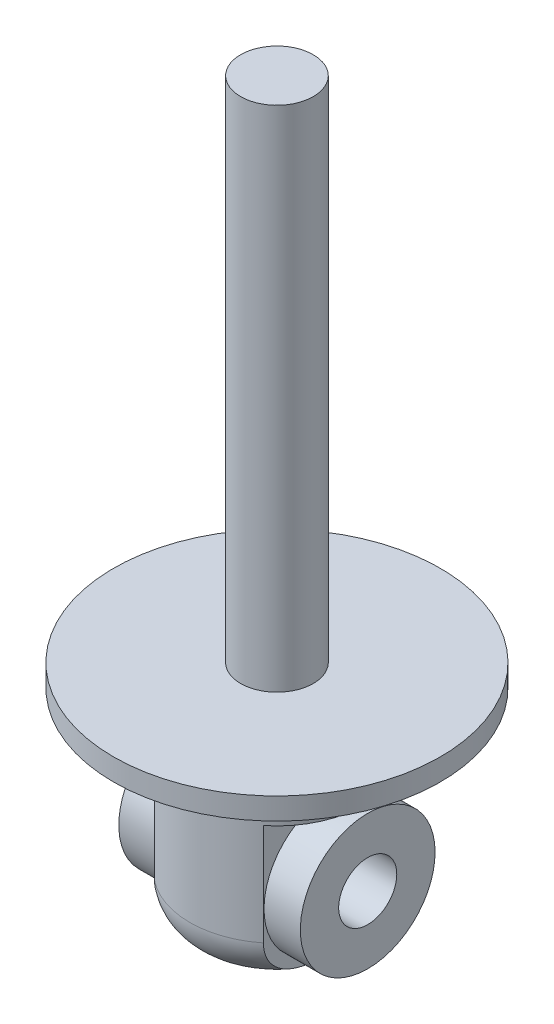
ISO-10303-21;
HEADER;
FILE_DESCRIPTION(('STEP AP214'),'2;1');
FILE_NAME('part.step','',(''),(''),'','','');
FILE_SCHEMA(('AUTOMOTIVE_DESIGN { 1 0 10303 214 1 1 1 1 }'));
ENDSEC;
DATA;
#1=APPLICATION_CONTEXT('core data for automotive mechanical design processes');
#2=APPLICATION_PROTOCOL_DEFINITION('international standard','automotive_design',2000,#1);
#3=PRODUCT_CONTEXT('',#1,'mechanical');
#4=PRODUCT('Part','Part','',(#3));
#5=PRODUCT_RELATED_PRODUCT_CATEGORY('part','',(#4));
#6=PRODUCT_DEFINITION_FORMATION('','',#4);
#7=PRODUCT_DEFINITION_CONTEXT('part definition',#1,'design');
#8=PRODUCT_DEFINITION('design','',#6,#7);
#9=PRODUCT_DEFINITION_SHAPE('','',#8);
#10=(LENGTH_UNIT() NAMED_UNIT(*) SI_UNIT(.MILLI.,.METRE.));
#11=(NAMED_UNIT(*) PLANE_ANGLE_UNIT() SI_UNIT($,.RADIAN.));
#12=(NAMED_UNIT(*) SI_UNIT($,.STERADIAN.) SOLID_ANGLE_UNIT());
#13=UNCERTAINTY_MEASURE_WITH_UNIT(LENGTH_MEASURE(1.E-05),#10,'distance_accuracy_value','');
#14=(GEOMETRIC_REPRESENTATION_CONTEXT(3) GLOBAL_UNCERTAINTY_ASSIGNED_CONTEXT((#13)) GLOBAL_UNIT_ASSIGNED_CONTEXT((#10,
#11,#12)) REPRESENTATION_CONTEXT('',''));
#15=CARTESIAN_POINT('',(0.,0.,0.));
#16=DIRECTION('',(0.,0.,1.));
#17=DIRECTION('',(1.,0.,0.));
#18=AXIS2_PLACEMENT_3D('',#15,#16,#17);
#19=CARTESIAN_POINT('',(7.5,-8.,-22.5));
#20=DIRECTION('',(-1.,0.,0.));
#21=DIRECTION('',(0.,-1.,0.));
#22=AXIS2_PLACEMENT_3D('',#19,#20,#21);
#23=PLANE('',#22);
#24=CARTESIAN_POINT('',(7.5,-27.8094750193111,0.));
#25=CARTESIAN_POINT('',(7.5,-27.8094752958151,-0.18452162824242));
#26=CARTESIAN_POINT('',(7.5,-27.8077270322999,-0.369043480287192));
#27=CARTESIAN_POINT('',(7.5,-27.8006130628877,-0.737999394292285));
#28=CARTESIAN_POINT('',(7.5,-27.7952477367066,-0.922433463434386));
#29=CARTESIAN_POINT('',(7.5,-27.780538513706,-1.29122559425462));
#30=CARTESIAN_POINT('',(7.5,-27.7711929215574,-1.47558358999919));
#31=CARTESIAN_POINT('',(7.5,-27.7479507640883,-1.84401846668315));
#32=CARTESIAN_POINT('',(7.5,-27.734054140347,-2.0280953439834));
#33=CARTESIAN_POINT('',(7.5,-27.701027325669,-2.39498843631837));
#34=CARTESIAN_POINT('',(7.5,-27.6819201299087,-2.57780665418327));
#35=CARTESIAN_POINT('',(7.5,-27.6375682217561,-2.94269408038084));
#36=CARTESIAN_POINT('',(7.5,-27.6123230495969,-3.12476323156505));
#37=CARTESIAN_POINT('',(7.5,-27.5259360262262,-3.6691632505479));
#38=CARTESIAN_POINT('',(7.5,-27.4541196223952,-4.02997739530099));
#39=CARTESIAN_POINT('',(7.5,-27.315114172541,-4.57935988961709));
#40=CARTESIAN_POINT('',(7.5,-27.2608348848703,-4.7712225645297));
#41=CARTESIAN_POINT('',(7.5,-27.1402411036094,-5.15109529504943));
#42=CARTESIAN_POINT('',(7.5,-27.0739312594077,-5.3391068078654));
#43=CARTESIAN_POINT('',(7.5,-26.9281486989919,-5.70992505463463));
#44=CARTESIAN_POINT('',(7.5,-26.8486797977089,-5.8927332791208));
#45=CARTESIAN_POINT('',(7.5,-26.6756224712841,-6.25155879665883));
#46=CARTESIAN_POINT('',(7.5,-26.5820364486501,-6.42757723883459));
#47=CARTESIAN_POINT('',(7.5,-26.3958384208508,-6.74413785402998));
#48=CARTESIAN_POINT('',(7.5,-26.3053527427416,-6.8859302136676));
#49=CARTESIAN_POINT('',(7.5,-26.1136422044668,-7.16205254122039));
#50=CARTESIAN_POINT('',(7.5,-26.0124194056704,-7.29638393401336));
#51=CARTESIAN_POINT('',(7.5,-25.7991822855038,-7.55627452274061));
#52=CARTESIAN_POINT('',(7.5,-25.6871652583255,-7.6818315054992));
#53=CARTESIAN_POINT('',(7.5,-25.4525813942248,-7.92270374400352));
#54=CARTESIAN_POINT('',(7.5,-25.3300144777409,-8.03801892249803));
#55=CARTESIAN_POINT('',(7.5,-25.0736714823962,-8.25792234562975));
#56=CARTESIAN_POINT('',(7.5,-24.9398051473305,-8.36240569865935));
#57=CARTESIAN_POINT('',(7.5,-24.662616920615,-8.55796576900282));
#58=CARTESIAN_POINT('',(7.5,-24.5192963548439,-8.64904436046083));
#59=CARTESIAN_POINT('',(7.5,-24.2243409104845,-8.81636481076627));
#60=CARTESIAN_POINT('',(7.5,-24.0727112205184,-8.89261579636783));
#61=CARTESIAN_POINT('',(7.5,-23.7624095052739,-9.02909243430965));
#62=CARTESIAN_POINT('',(7.5,-23.6037388369551,-9.08932115899453));
#63=CARTESIAN_POINT('',(7.5,-23.3052245459151,-9.1849514334904));
#64=CARTESIAN_POINT('',(7.5,-23.166136129491,-9.22272405795733));
#65=CARTESIAN_POINT('',(7.5,-22.8851087613884,-9.28547940350163));
#66=CARTESIAN_POINT('',(7.5,-22.7431701638949,-9.31046370365637));
#67=CARTESIAN_POINT('',(7.5,-22.4576599589478,-9.34730641699015));
#68=CARTESIAN_POINT('',(7.5,-22.3140890586128,-9.35917031033292));
#69=CARTESIAN_POINT('',(7.5,-22.0264648581988,-9.36963164548865));
#70=CARTESIAN_POINT('',(7.5,-21.8824115750842,-9.36822954903947));
#71=CARTESIAN_POINT('',(7.5,-21.6061914815275,-9.35280339576898));
#72=CARTESIAN_POINT('',(7.5,-21.4739684759153,-9.33976569953801));
#73=CARTESIAN_POINT('',(7.5,-21.2110534946456,-9.3025636387872));
#74=CARTESIAN_POINT('',(7.5,-21.0803620180608,-9.27839574533065));
#75=CARTESIAN_POINT('',(7.5,-20.8215410609612,-9.21922065645586));
#76=CARTESIAN_POINT('',(7.5,-20.6934101253726,-9.1842198149556));
#77=CARTESIAN_POINT('',(7.5,-20.4404340442512,-9.1037455253616));
#78=CARTESIAN_POINT('',(7.5,-20.3155901493276,-9.05826815366643));
#79=CARTESIAN_POINT('',(7.5,-20.0692031015505,-8.95699564520569));
#80=CARTESIAN_POINT('',(7.5,-19.9476868658852,-8.90113499399755));
#81=CARTESIAN_POINT('',(7.5,-19.7094920695403,-8.77987692751896));
#82=CARTESIAN_POINT('',(7.5,-19.5928152563103,-8.71447610526942));
#83=CARTESIAN_POINT('',(7.5,-19.2509911073174,-8.50489875856371));
#84=CARTESIAN_POINT('',(7.5,-19.0339195251877,-8.34729299116933));
#85=CARTESIAN_POINT('',(7.5,-18.609337427954,-7.98870608163152));
#86=CARTESIAN_POINT('',(7.5,-18.4039002281567,-7.78529755950601));
#87=CARTESIAN_POINT('',(7.5,-18.0246758733926,-7.35109040646742));
#88=CARTESIAN_POINT('',(7.5,-17.8508837047537,-7.12029612399674));
#89=CARTESIAN_POINT('',(7.5,-17.5744409595824,-6.69864287979114));
#90=CARTESIAN_POINT('',(7.5,-17.4648689537028,-6.51223410047272));
#91=CARTESIAN_POINT('',(7.5,-17.2626904112622,-6.13034538679085));
#92=CARTESIAN_POINT('',(7.5,-17.1700919878543,-5.93486117014358));
#93=CARTESIAN_POINT('',(7.5,-17.0006313082269,-5.53658641063457));
#94=CARTESIAN_POINT('',(7.5,-16.9238147555949,-5.33377659321379));
#95=CARTESIAN_POINT('',(7.5,-16.784875362625,-4.92331428460809));
#96=CARTESIAN_POINT('',(7.5,-16.7227484430634,-4.71566315546473));
#97=CARTESIAN_POINT('',(7.5,-16.5386673542946,-4.02250667384634));
#98=CARTESIAN_POINT('',(7.5,-16.4449803111871,-3.5294265636988));
#99=CARTESIAN_POINT('',(7.5,-16.3412352530644,-2.78498720051465));
#100=CARTESIAN_POINT('',(7.5,-16.3127705467372,-2.53568557770048));
#101=CARTESIAN_POINT('',(7.5,-16.2658269581612,-2.03612434937437));
#102=CARTESIAN_POINT('',(7.5,-16.2473468655649,-1.7858648636814));
#103=CARTESIAN_POINT('',(7.5,-16.2184283009414,-1.28363112408651));
#104=CARTESIAN_POINT('',(7.5,-16.208031590786,-1.0316546617609));
#105=CARTESIAN_POINT('',(7.5,-16.1941849220444,-0.527501194688666));
#106=CARTESIAN_POINT('',(7.5,-16.1907352988047,-0.275324180848896));
#107=CARTESIAN_POINT('',(7.5,-16.1903333462322,0.228731345602991));
#108=CARTESIAN_POINT('',(7.5,-16.193373232494,0.480609853630189));
#109=CARTESIAN_POINT('',(7.5,-16.2063332691715,0.984173581494281));
#110=CARTESIAN_POINT('',(7.5,-16.2162528039696,1.23585881660875));
#111=CARTESIAN_POINT('',(7.5,-16.2454935008677,1.76278825668935));
#112=CARTESIAN_POINT('',(7.5,-16.2656211327378,2.03798990109173));
#113=CARTESIAN_POINT('',(7.5,-16.3180418431018,2.5873134597684));
#114=CARTESIAN_POINT('',(7.5,-16.3503365349836,2.86143522597445));
#115=CARTESIAN_POINT('',(7.5,-16.4300545548583,3.40623279358438));
#116=CARTESIAN_POINT('',(7.5,-16.4774071358833,3.67691867401874));
#117=CARTESIAN_POINT('',(7.5,-16.5907053400646,4.21439476079952));
#118=CARTESIAN_POINT('',(7.5,-16.6566449229111,4.48118620316471));
#119=CARTESIAN_POINT('',(7.5,-16.7911834026755,4.94217748017443));
#120=CARTESIAN_POINT('',(7.5,-16.8549558474619,5.13778160857808));
#121=CARTESIAN_POINT('',(7.5,-16.9961265709521,5.5239942274174));
#122=CARTESIAN_POINT('',(7.5,-17.073520789267,5.71460418712137));
#123=CARTESIAN_POINT('',(7.5,-17.2430793617625,6.0892198722189));
#124=CARTESIAN_POINT('',(7.5,-17.3352463319138,6.27322442084439));
#125=CARTESIAN_POINT('',(7.5,-17.5351759469553,6.63256976145458));
#126=CARTESIAN_POINT('',(7.5,-17.6429345063483,6.80791280693598));
#127=CARTESIAN_POINT('',(7.5,-17.8487615005737,7.10989658300674));
#128=CARTESIAN_POINT('',(7.5,-17.9436617626469,7.2387010399764));
#129=CARTESIAN_POINT('',(7.5,-18.143229826346,7.4885662206622));
#130=CARTESIAN_POINT('',(7.5,-18.2478987883735,7.60962602152205));
#131=CARTESIAN_POINT('',(7.5,-18.4668045949393,7.84271387792474));
#132=CARTESIAN_POINT('',(7.5,-18.5810384459287,7.95474473789612));
#133=CARTESIAN_POINT('',(7.5,-18.8187268203134,8.16854933672494));
#134=CARTESIAN_POINT('',(7.5,-18.9421800591116,8.27032449994957));
#135=CARTESIAN_POINT('',(7.5,-19.1987356397018,8.46313596223061));
#136=CARTESIAN_POINT('',(7.5,-19.3319055781875,8.55408255407203));
#137=CARTESIAN_POINT('',(7.5,-19.6061418402457,8.72304401015934));
#138=CARTESIAN_POINT('',(7.5,-19.747204378254,8.80106500403696));
#139=CARTESIAN_POINT('',(7.5,-20.0362068877473,8.94309470867639));
#140=CARTESIAN_POINT('',(7.5,-20.1841460034049,9.00710515749598));
#141=CARTESIAN_POINT('',(7.5,-20.4856380297523,9.12014361193692));
#142=CARTESIAN_POINT('',(7.5,-20.6391901444676,9.16917373274798));
#143=CARTESIAN_POINT('',(7.5,-20.9313639562727,9.24643392787081));
#144=CARTESIAN_POINT('',(7.5,-21.0695088202567,9.27647685632879));
#145=CARTESIAN_POINT('',(7.5,-21.3479315795213,9.32406143536891));
#146=CARTESIAN_POINT('',(7.5,-21.4882092809527,9.34160421520928));
#147=CARTESIAN_POINT('',(7.5,-21.769719609589,9.36396002322678));
#148=CARTESIAN_POINT('',(7.5,-21.9109518422674,9.3687780225304));
#149=CARTESIAN_POINT('',(7.5,-22.1932734390957,9.3656361390626));
#150=CARTESIAN_POINT('',(7.5,-22.3343628067459,9.35767657732181));
#151=CARTESIAN_POINT('',(7.5,-22.6064011749062,9.32998563551062));
#152=CARTESIAN_POINT('',(7.5,-22.7374295539783,9.31102660205278));
#153=CARTESIAN_POINT('',(7.5,-22.9974780227225,9.26218788836621));
#154=CARTESIAN_POINT('',(7.5,-23.1264974548056,9.23230470755187));
#155=CARTESIAN_POINT('',(7.5,-23.3815508516768,9.16196479385525));
#156=CARTESIAN_POINT('',(7.5,-23.5075862018083,9.12151307666088));
#157=CARTESIAN_POINT('',(7.5,-23.7559772755244,9.03044888037393));
#158=CARTESIAN_POINT('',(7.5,-23.8783315975104,8.97983258590813));
#159=CARTESIAN_POINT('',(7.5,-24.1205569584555,8.86806175742509));
#160=CARTESIAN_POINT('',(7.5,-24.2403549182387,8.8067487702029));
#161=CARTESIAN_POINT('',(7.5,-24.4747211723639,8.67480187441993));
#162=CARTESIAN_POINT('',(7.5,-24.5892875713423,8.60416462323316));
#163=CARTESIAN_POINT('',(7.5,-24.9242270275788,8.37928997825773));
#164=CARTESIAN_POINT('',(7.5,-25.13600210755,8.21201407264851));
#165=CARTESIAN_POINT('',(7.5,-25.5504485361803,7.832942739178));
#166=CARTESIAN_POINT('',(7.5,-25.7507010772538,7.61853228584699));
#167=CARTESIAN_POINT('',(7.5,-26.1185076671662,7.16337882817298));
#168=CARTESIAN_POINT('',(7.5,-26.2860513710234,6.92262753032979));
#169=CARTESIAN_POINT('',(7.5,-26.5545024709803,6.4788664395953));
#170=CARTESIAN_POINT('',(7.5,-26.6619013252763,6.27970729507799));
#171=CARTESIAN_POINT('',(7.5,-26.858559219587,5.87254463104012));
#172=CARTESIAN_POINT('',(7.5,-26.9478095430477,5.664536919364));
#173=CARTESIAN_POINT('',(7.5,-27.1096214973705,5.24180758530232));
#174=CARTESIAN_POINT('',(7.5,-27.1821555960046,5.02707553901331));
#175=CARTESIAN_POINT('',(7.5,-27.3121001369762,4.59305326757355));
#176=CARTESIAN_POINT('',(7.5,-27.3695048137837,4.37376133898656));
#177=CARTESIAN_POINT('',(7.5,-27.4981886749365,3.81417726059936));
#178=CARTESIAN_POINT('',(7.5,-27.5604951716191,3.47183296905169));
#179=CARTESIAN_POINT('',(7.5,-27.6609019684328,2.78359200614869));
#180=CARTESIAN_POINT('',(7.5,-27.6989863972919,2.43769315620305));
#181=CARTESIAN_POINT('',(7.5,-27.7425563308733,1.91723181279187));
#182=CARTESIAN_POINT('',(7.5,-27.7548291128016,1.74318957751326));
#183=CARTESIAN_POINT('',(7.5,-27.7753986995787,1.39487161182967));
#184=CARTESIAN_POINT('',(7.5,-27.7836956019396,1.22059588725638));
#185=CARTESIAN_POINT('',(7.5,-27.796777523185,0.871965392986036));
#186=CARTESIAN_POINT('',(7.5,-27.8015635129394,0.697610658492169));
#187=CARTESIAN_POINT('',(7.5,-27.8079121855994,0.348837350643893));
#188=CARTESIAN_POINT('',(7.5,-27.8094747579462,0.174418775305038));
#189=CARTESIAN_POINT('',(7.5,-27.8094750193111,0.));
#190=B_SPLINE_CURVE_WITH_KNOTS('',3,(#24,#25,#26,#27,#28,#29,#30,#31,#32,#33,#34,#35,#36,#37,
#38,#39,#40,#41,#42,#43,#44,#45,#46,#47,#48,#49,#50,#51,#52,#53,#54,#55,#56,#57,#58,#59,#60,#61,
#62,#63,#64,#65,#66,#67,#68,#69,#70,#71,#72,#73,#74,#75,#76,#77,#78,#79,#80,#81,#82,#83,#84,#85,
#86,#87,#88,#89,#90,#91,#92,#93,#94,#95,#96,#97,#98,#99,#100,#101,#102,#103,#104,#105,#106,#107,
#108,#109,#110,#111,#112,#113,#114,#115,#116,#117,#118,#119,#120,#121,#122,#123,#124,#125,#126,
#127,#128,#129,#130,#131,#132,#133,#134,#135,#136,#137,#138,#139,#140,#141,#142,#143,#144,#145,
#146,#147,#148,#149,#150,#151,#152,#153,#154,#155,#156,#157,#158,#159,#160,#161,#162,#163,#164,
#165,#166,#167,#168,#169,#170,#171,#172,#173,#174,#175,#176,#177,#178,#179,#180,#181,#182,#183,
#184,#185,#186,#187,#188,#189),.UNSPECIFIED.,.T.,.F.,(4,2,2,2,2,2,2,2,2,2,2,2,2,2,2,2,2,2,2,2,2,
2,2,2,2,2,2,2,2,2,2,2,2,2,2,2,2,2,2,2,2,2,2,2,2,2,2,2,2,2,2,2,2,2,2,2,2,2,2,2,2,2,2,2,2,2,2,2,2,
2,2,2,2,2,2,2,2,2,2,2,2,2,4),(0.,0.553556541747909,1.10705498067111,1.66078940935171,
2.21453094651203,2.7658672034967,3.31724477121586,4.41912680182767,5.01698525599298,
5.61461314908643,6.21206808675635,6.80942146164093,7.31357153503217,7.81762499361292,
8.32180513447662,8.82598907791494,9.33467160980089,9.84328295415677,10.3515802378956,
10.8597799828438,11.291588037567,11.7233427606026,12.1549170790764,12.5864763761707,
12.9845986570771,13.3828472534997,13.7808627038906,14.1790274594522,14.579795450788,
14.9807069160888,15.7821103743006,16.6461503316802,17.5100532757815,18.1578732554314,
18.8060020817716,19.4559821948789,20.1057815998326,21.6069748462106,22.3596793389022,
23.1122925673176,23.8687687149109,24.6252813779039,25.3808870860739,26.1364251884592,
26.9640249034878,27.7917343993232,28.6156111127982,29.4392203950451,30.0559954213971,
30.6725869093732,31.2892877047367,31.9058271963482,32.3853559200308,32.8649416785199,
33.3443778968313,33.823747436381,34.3068464150843,34.7897156366603,35.2725249226045,
35.7552660053908,36.1788379642465,36.6023716529342,37.0257398573389,37.4490974249689,
37.8458122806135,38.2426543730445,38.6393084704929,39.0361117351622,39.4393886143667,
39.8428104576491,40.6491243408277,41.5260051520067,42.4031628508039,43.0810551134699,
43.7592721958252,44.4385984678267,45.1181832448308,46.1608437011148,47.2041866484774,
47.7275747628343,48.2509500399341,48.7741805338585,49.2974289735857),.UNSPECIFIED.);
#191=CARTESIAN_POINT('',(7.5,-22.,9.3674969975976));
#192=VERTEX_POINT('',#191);
#193=CARTESIAN_POINT('',(7.5,-21.9999999999999,-9.36749699759765));
#194=VERTEX_POINT('',#193);
#195=EDGE_CURVE('E126',#192,#194,#190,.T.);
#196=ORIENTED_EDGE('',*,*,#195,.T.);
#197=DIRECTION('',(0.,1.,0.));
#198=VECTOR('',#197,1.);
#199=CARTESIAN_POINT('',(7.5,-28.,-9.3674969975976));
#200=LINE('',#199,#198);
#201=CARTESIAN_POINT('',(7.5,-8.,-9.3674969975976));
#202=VERTEX_POINT('',#201);
#203=EDGE_CURVE('E100',#202,#194,#200,.F.);
#204=ORIENTED_EDGE('',*,*,#203,.F.);
#205=DIRECTION('',(0.,0.,1.));
#206=VECTOR('',#205,1.);
#207=CARTESIAN_POINT('',(7.5,-8.,-22.5));
#208=LINE('',#207,#206);
#209=CARTESIAN_POINT('',(7.5,-8.,9.3674969975976));
#210=VERTEX_POINT('',#209);
#211=EDGE_CURVE('E97',#202,#210,#208,.T.);
#212=ORIENTED_EDGE('',*,*,#211,.T.);
#213=DIRECTION('',(0.,1.,0.));
#214=VECTOR('',#213,1.);
#215=CARTESIAN_POINT('',(7.5,-28.,9.3674969975976));
#216=LINE('',#215,#214);
#217=EDGE_CURVE('E105',#192,#210,#216,.T.);
#218=ORIENTED_EDGE('',*,*,#217,.F.);
#219=EDGE_LOOP('',(#196,#204,#212,#218));
#220=FACE_BOUND('',#219,.T.);
#221=CARTESIAN_POINT('',(7.5,-18.,0.));
#222=DIRECTION('',(-1.,0.,0.));
#223=DIRECTION('',(0.,-1.,0.));
#224=AXIS2_PLACEMENT_3D('',#221,#222,#223);
#225=CIRCLE('',#224,9.27822291982509);
#226=CARTESIAN_POINT('',(7.5,-27.2782229198251,0.));
#227=VERTEX_POINT('',#226);
#228=EDGE_CURVE('E11',#227,#227,#225,.F.);
#229=ORIENTED_EDGE('',*,*,#228,.F.);
#230=EDGE_LOOP('',(#229));
#231=FACE_BOUND('',#230,.T.);
#232=ADVANCED_FACE('F36',(#220,#231),#23,.F.);
#233=CARTESIAN_POINT('',(-7.5,-8.,-22.5));
#234=DIRECTION('',(1.,0.,0.));
#235=DIRECTION('',(0.,1.,0.));
#236=AXIS2_PLACEMENT_3D('',#233,#234,#235);
#237=PLANE('',#236);
#238=CARTESIAN_POINT('',(-7.5,-27.8094750193111,0.));
#239=CARTESIAN_POINT('',(-7.5,-27.8094752958151,0.184521628242419));
#240=CARTESIAN_POINT('',(-7.5,-27.8077270322999,0.369043480287191));
#241=CARTESIAN_POINT('',(-7.5,-27.8006130628877,0.737999394292284));
#242=CARTESIAN_POINT('',(-7.5,-27.7952477367066,0.922433463434383));
#243=CARTESIAN_POINT('',(-7.5,-27.780538513706,1.29122559425462));
#244=CARTESIAN_POINT('',(-7.5,-27.7711929215574,1.47558358999919));
#245=CARTESIAN_POINT('',(-7.5,-27.7479507640883,1.84401846668315));
#246=CARTESIAN_POINT('',(-7.5,-27.734054140347,2.02809534398339));
#247=CARTESIAN_POINT('',(-7.5,-27.701027325669,2.39498843631837));
#248=CARTESIAN_POINT('',(-7.5,-27.6819201299087,2.57780665418326));
#249=CARTESIAN_POINT('',(-7.5,-27.6375682217561,2.94269408038083));
#250=CARTESIAN_POINT('',(-7.5,-27.6123230495969,3.12476323156505));
#251=CARTESIAN_POINT('',(-7.5,-27.5259360262262,3.6691632505479));
#252=CARTESIAN_POINT('',(-7.5,-27.4541196223952,4.02997739530099));
#253=CARTESIAN_POINT('',(-7.5,-27.315114172541,4.57935988961709));
#254=CARTESIAN_POINT('',(-7.5,-27.2608348848703,4.77122256452969));
#255=CARTESIAN_POINT('',(-7.5,-27.1402411036094,5.15109529504942));
#256=CARTESIAN_POINT('',(-7.5,-27.0739312594077,5.33910680786539));
#257=CARTESIAN_POINT('',(-7.5,-26.928148698992,5.70992505463463));
#258=CARTESIAN_POINT('',(-7.5,-26.8486797977089,5.8927332791208));
#259=CARTESIAN_POINT('',(-7.5,-26.6756224712841,6.25155879665883));
#260=CARTESIAN_POINT('',(-7.5,-26.5820364486502,6.42757723883459));
#261=CARTESIAN_POINT('',(-7.5,-26.3958384208508,6.74413785402998));
#262=CARTESIAN_POINT('',(-7.5,-26.3053527427416,6.8859302136676));
#263=CARTESIAN_POINT('',(-7.5,-26.1136422044668,7.16205254122039));
#264=CARTESIAN_POINT('',(-7.5,-26.0124194056704,7.29638393401336));
#265=CARTESIAN_POINT('',(-7.5,-25.7991822855038,7.55627452274061));
#266=CARTESIAN_POINT('',(-7.5,-25.6871652583255,7.6818315054992));
#267=CARTESIAN_POINT('',(-7.5,-25.4525813942248,7.92270374400352));
#268=CARTESIAN_POINT('',(-7.5,-25.3300144777409,8.03801892249803));
#269=CARTESIAN_POINT('',(-7.5,-25.0736714823962,8.25792234562975));
#270=CARTESIAN_POINT('',(-7.5,-24.9398051473305,8.36240569865935));
#271=CARTESIAN_POINT('',(-7.5,-24.662616920615,8.55796576900282));
#272=CARTESIAN_POINT('',(-7.5,-24.5192963548439,8.64904436046083));
#273=CARTESIAN_POINT('',(-7.5,-24.2243409104845,8.81636481076627));
#274=CARTESIAN_POINT('',(-7.5,-24.0727112205184,8.89261579636784));
#275=CARTESIAN_POINT('',(-7.5,-23.7624095052739,9.02909243430965));
#276=CARTESIAN_POINT('',(-7.5,-23.6037388369551,9.08932115899453));
#277=CARTESIAN_POINT('',(-7.5,-23.3052245459151,9.1849514334904));
#278=CARTESIAN_POINT('',(-7.5,-23.1661361294911,9.22272405795734));
#279=CARTESIAN_POINT('',(-7.5,-22.8851087613884,9.28547940350164));
#280=CARTESIAN_POINT('',(-7.5,-22.7431701638949,9.31046370365637));
#281=CARTESIAN_POINT('',(-7.5,-22.4576599589478,9.34730641699016));
#282=CARTESIAN_POINT('',(-7.5,-22.3140890586128,9.35917031033292));
#283=CARTESIAN_POINT('',(-7.5,-22.0264648581988,9.36963164548865));
#284=CARTESIAN_POINT('',(-7.5,-21.8824115750842,9.36822954903948));
#285=CARTESIAN_POINT('',(-7.5,-21.6061914815275,9.35280339576898));
#286=CARTESIAN_POINT('',(-7.5,-21.4739684759154,9.33976569953801));
#287=CARTESIAN_POINT('',(-7.5,-21.2110534946456,9.30256363878721));
#288=CARTESIAN_POINT('',(-7.5,-21.0803620180608,9.27839574533066));
#289=CARTESIAN_POINT('',(-7.5,-20.8215410609612,9.21922065645586));
#290=CARTESIAN_POINT('',(-7.5,-20.6934101253726,9.18421981495561));
#291=CARTESIAN_POINT('',(-7.5,-20.4404340442512,9.10374552536161));
#292=CARTESIAN_POINT('',(-7.5,-20.3155901493276,9.05826815366643));
#293=CARTESIAN_POINT('',(-7.5,-20.0692031015505,8.95699564520569));
#294=CARTESIAN_POINT('',(-7.5,-19.9476868658852,8.90113499399756));
#295=CARTESIAN_POINT('',(-7.5,-19.7094920695403,8.77987692751897));
#296=CARTESIAN_POINT('',(-7.5,-19.5928152563103,8.71447610526943));
#297=CARTESIAN_POINT('',(-7.5,-19.2509911073174,8.50489875856372));
#298=CARTESIAN_POINT('',(-7.5,-19.0339195251877,8.34729299116935));
#299=CARTESIAN_POINT('',(-7.5,-18.609337427954,7.98870608163153));
#300=CARTESIAN_POINT('',(-7.5,-18.4039002281567,7.78529755950601));
#301=CARTESIAN_POINT('',(-7.5,-18.0246758733926,7.35109040646743));
#302=CARTESIAN_POINT('',(-7.5,-17.8508837047537,7.12029612399674));
#303=CARTESIAN_POINT('',(-7.5,-17.5744409595824,6.69864287979115));
#304=CARTESIAN_POINT('',(-7.5,-17.4648689537028,6.51223410047273));
#305=CARTESIAN_POINT('',(-7.5,-17.2626904112623,6.13034538679086));
#306=CARTESIAN_POINT('',(-7.5,-17.1700919878543,5.93486117014359));
#307=CARTESIAN_POINT('',(-7.5,-17.0006313082269,5.53658641063458));
#308=CARTESIAN_POINT('',(-7.5,-16.9238147555949,5.33377659321381));
#309=CARTESIAN_POINT('',(-7.5,-16.784875362625,4.92331428460811));
#310=CARTESIAN_POINT('',(-7.5,-16.7227484430634,4.71566315546475));
#311=CARTESIAN_POINT('',(-7.5,-16.5386673542946,4.02250667384636));
#312=CARTESIAN_POINT('',(-7.5,-16.4449803111871,3.52942656369883));
#313=CARTESIAN_POINT('',(-7.5,-16.3412352530644,2.78498720051468));
#314=CARTESIAN_POINT('',(-7.5,-16.3127705467372,2.53568557770051));
#315=CARTESIAN_POINT('',(-7.5,-16.2658269581612,2.0361243493744));
#316=CARTESIAN_POINT('',(-7.5,-16.2473468655649,1.78586486368144));
#317=CARTESIAN_POINT('',(-7.5,-16.2184283009414,1.28363112408655));
#318=CARTESIAN_POINT('',(-7.5,-16.208031590786,1.03165466176094));
#319=CARTESIAN_POINT('',(-7.5,-16.1941849220444,0.527501194688707));
#320=CARTESIAN_POINT('',(-7.5,-16.1907352988047,0.27532418084894));
#321=CARTESIAN_POINT('',(-7.5,-16.1903333462322,-0.228731345602946));
#322=CARTESIAN_POINT('',(-7.5,-16.193373232494,-0.480609853630145));
#323=CARTESIAN_POINT('',(-7.5,-16.2063332691715,-0.984173581494236));
#324=CARTESIAN_POINT('',(-7.5,-16.2162528039696,-1.23585881660871));
#325=CARTESIAN_POINT('',(-7.5,-16.2454935008677,-1.7627882566893));
#326=CARTESIAN_POINT('',(-7.5,-16.2656211327378,-2.03798990109168));
#327=CARTESIAN_POINT('',(-7.5,-16.3180418431017,-2.58731345976836));
#328=CARTESIAN_POINT('',(-7.5,-16.3503365349836,-2.86143522597441));
#329=CARTESIAN_POINT('',(-7.5,-16.4300545548583,-3.40623279358435));
#330=CARTESIAN_POINT('',(-7.5,-16.4774071358833,-3.67691867401872));
#331=CARTESIAN_POINT('',(-7.5,-16.5907053400646,-4.2143947607995));
#332=CARTESIAN_POINT('',(-7.5,-16.6566449229111,-4.48118620316469));
#333=CARTESIAN_POINT('',(-7.5,-16.7911834026755,-4.94217748017442));
#334=CARTESIAN_POINT('',(-7.5,-16.8549558474619,-5.13778160857807));
#335=CARTESIAN_POINT('',(-7.5,-16.9961265709521,-5.52399422741739));
#336=CARTESIAN_POINT('',(-7.5,-17.0735207892669,-5.71460418712136));
#337=CARTESIAN_POINT('',(-7.5,-17.2430793617625,-6.08921987221889));
#338=CARTESIAN_POINT('',(-7.5,-17.3352463319138,-6.27322442084438));
#339=CARTESIAN_POINT('',(-7.5,-17.5351759469553,-6.63256976145457));
#340=CARTESIAN_POINT('',(-7.5,-17.6429345063483,-6.80791280693597));
#341=CARTESIAN_POINT('',(-7.5,-17.8487615005736,-7.10989658300674));
#342=CARTESIAN_POINT('',(-7.5,-17.9436617626469,-7.23870103997639));
#343=CARTESIAN_POINT('',(-7.5,-18.143229826346,-7.48856622066219));
#344=CARTESIAN_POINT('',(-7.5,-18.2478987883735,-7.60962602152205));
#345=CARTESIAN_POINT('',(-7.5,-18.4668045949393,-7.84271387792474));
#346=CARTESIAN_POINT('',(-7.5,-18.5810384459287,-7.95474473789612));
#347=CARTESIAN_POINT('',(-7.5,-18.8187268203134,-8.16854933672495));
#348=CARTESIAN_POINT('',(-7.5,-18.9421800591116,-8.27032449994957));
#349=CARTESIAN_POINT('',(-7.5,-19.1987356397018,-8.46313596223061));
#350=CARTESIAN_POINT('',(-7.5,-19.3319055781875,-8.55408255407203));
#351=CARTESIAN_POINT('',(-7.5,-19.6061418402457,-8.72304401015934));
#352=CARTESIAN_POINT('',(-7.5,-19.747204378254,-8.80106500403696));
#353=CARTESIAN_POINT('',(-7.5,-20.0362068877473,-8.94309470867639));
#354=CARTESIAN_POINT('',(-7.5,-20.1841460034049,-9.00710515749598));
#355=CARTESIAN_POINT('',(-7.5,-20.4856380297523,-9.12014361193693));
#356=CARTESIAN_POINT('',(-7.5,-20.6391901444676,-9.16917373274798));
#357=CARTESIAN_POINT('',(-7.5,-20.9313639562727,-9.24643392787081));
#358=CARTESIAN_POINT('',(-7.5,-21.0695088202567,-9.27647685632879));
#359=CARTESIAN_POINT('',(-7.5,-21.3479315795213,-9.32406143536891));
#360=CARTESIAN_POINT('',(-7.5,-21.4882092809526,-9.34160421520928));
#361=CARTESIAN_POINT('',(-7.5,-21.769719609589,-9.36396002322679));
#362=CARTESIAN_POINT('',(-7.5,-21.9109518422674,-9.36877802253041));
#363=CARTESIAN_POINT('',(-7.5,-22.1932734390957,-9.36563613906261));
#364=CARTESIAN_POINT('',(-7.5,-22.3343628067459,-9.35767657732182));
#365=CARTESIAN_POINT('',(-7.5,-22.6064011749062,-9.32998563551062));
#366=CARTESIAN_POINT('',(-7.5,-22.7374295539783,-9.31102660205279));
#367=CARTESIAN_POINT('',(-7.5,-22.9974780227225,-9.26218788836622));
#368=CARTESIAN_POINT('',(-7.5,-23.1264974548056,-9.23230470755188));
#369=CARTESIAN_POINT('',(-7.5,-23.3815508516768,-9.16196479385526));
#370=CARTESIAN_POINT('',(-7.5,-23.5075862018083,-9.12151307666088));
#371=CARTESIAN_POINT('',(-7.5,-23.7559772755244,-9.03044888037393));
#372=CARTESIAN_POINT('',(-7.5,-23.8783315975104,-8.97983258590814));
#373=CARTESIAN_POINT('',(-7.5,-24.1205569584555,-8.8680617574251));
#374=CARTESIAN_POINT('',(-7.5,-24.2403549182387,-8.80674877020291));
#375=CARTESIAN_POINT('',(-7.5,-24.4747211723639,-8.67480187441993));
#376=CARTESIAN_POINT('',(-7.5,-24.5892875713423,-8.60416462323317));
#377=CARTESIAN_POINT('',(-7.5,-24.9242270275788,-8.37928997825773));
#378=CARTESIAN_POINT('',(-7.5,-25.13600210755,-8.21201407264852));
#379=CARTESIAN_POINT('',(-7.5,-25.5504485361803,-7.832942739178));
#380=CARTESIAN_POINT('',(-7.5,-25.7507010772538,-7.618532285847));
#381=CARTESIAN_POINT('',(-7.5,-26.1185076671662,-7.16337882817298));
#382=CARTESIAN_POINT('',(-7.5,-26.2860513710234,-6.9226275303298));
#383=CARTESIAN_POINT('',(-7.5,-26.5545024709803,-6.4788664395953));
#384=CARTESIAN_POINT('',(-7.5,-26.6619013252763,-6.279707295078));
#385=CARTESIAN_POINT('',(-7.5,-26.858559219587,-5.87254463104013));
#386=CARTESIAN_POINT('',(-7.5,-26.9478095430477,-5.66453691936401));
#387=CARTESIAN_POINT('',(-7.5,-27.1096214973705,-5.24180758530233));
#388=CARTESIAN_POINT('',(-7.5,-27.1821555960046,-5.02707553901332));
#389=CARTESIAN_POINT('',(-7.5,-27.3121001369762,-4.59305326757356));
#390=CARTESIAN_POINT('',(-7.5,-27.3695048137837,-4.37376133898656));
#391=CARTESIAN_POINT('',(-7.5,-27.4981886749365,-3.81417726059937));
#392=CARTESIAN_POINT('',(-7.5,-27.5604951716191,-3.47183296905169));
#393=CARTESIAN_POINT('',(-7.5,-27.6609019684328,-2.78359200614869));
#394=CARTESIAN_POINT('',(-7.5,-27.6989863972919,-2.43769315620305));
#395=CARTESIAN_POINT('',(-7.5,-27.7425563308733,-1.91723181279188));
#396=CARTESIAN_POINT('',(-7.5,-27.7548291128016,-1.74318957751326));
#397=CARTESIAN_POINT('',(-7.5,-27.7753986995787,-1.39487161182967));
#398=CARTESIAN_POINT('',(-7.5,-27.7836956019396,-1.22059588725638));
#399=CARTESIAN_POINT('',(-7.5,-27.796777523185,-0.87196539298604));
#400=CARTESIAN_POINT('',(-7.5,-27.8015635129394,-0.697610658492172));
#401=CARTESIAN_POINT('',(-7.5,-27.8079121855994,-0.348837350643895));
#402=CARTESIAN_POINT('',(-7.5,-27.8094747579462,-0.174418775305039));
#403=CARTESIAN_POINT('',(-7.5,-27.8094750193111,0.));
#404=B_SPLINE_CURVE_WITH_KNOTS('',3,(#238,#239,#240,#241,#242,#243,#244,#245,#246,#247,#248,
#249,#250,#251,#252,#253,#254,#255,#256,#257,#258,#259,#260,#261,#262,#263,#264,#265,#266,#267,
#268,#269,#270,#271,#272,#273,#274,#275,#276,#277,#278,#279,#280,#281,#282,#283,#284,#285,#286,
#287,#288,#289,#290,#291,#292,#293,#294,#295,#296,#297,#298,#299,#300,#301,#302,#303,#304,#305,
#306,#307,#308,#309,#310,#311,#312,#313,#314,#315,#316,#317,#318,#319,#320,#321,#322,#323,#324,
#325,#326,#327,#328,#329,#330,#331,#332,#333,#334,#335,#336,#337,#338,#339,#340,#341,#342,#343,
#344,#345,#346,#347,#348,#349,#350,#351,#352,#353,#354,#355,#356,#357,#358,#359,#360,#361,#362,
#363,#364,#365,#366,#367,#368,#369,#370,#371,#372,#373,#374,#375,#376,#377,#378,#379,#380,#381,
#382,#383,#384,#385,#386,#387,#388,#389,#390,#391,#392,#393,#394,#395,#396,#397,#398,#399,#400,
#401,#402,#403),.UNSPECIFIED.,.T.,.F.,(4,2,2,2,2,2,2,2,2,2,2,2,2,2,2,2,2,2,2,2,2,2,2,2,2,2,2,2,
2,2,2,2,2,2,2,2,2,2,2,2,2,2,2,2,2,2,2,2,2,2,2,2,2,2,2,2,2,2,2,2,2,2,2,2,2,2,2,2,2,2,2,2,2,2,2,2,
2,2,2,2,2,2,4),(0.,0.553556541747908,1.10705498067111,1.6607894093517,2.21453094651203,
2.76586720349669,3.31724477121585,4.41912680182766,5.01698525599297,5.61461314908642,
6.21206808675634,6.80942146164093,7.31357153503217,7.81762499361292,8.32180513447662,
8.82598907791493,9.33467160980088,9.84328295415676,10.3515802378956,10.8597799828438,
11.291588037567,11.7233427606026,12.1549170790764,12.5864763761706,12.9845986570771,
13.3828472534997,13.7808627038906,14.1790274594522,14.579795450788,14.9807069160888,
15.7821103743006,16.6461503316802,17.5100532757815,18.1578732554314,18.8060020817716,
19.4559821948789,20.1057815998326,21.6069748462105,22.3596793389022,23.1122925673176,
23.8687687149109,24.6252813779039,25.3808870860738,26.1364251884592,26.9640249034878,
27.7917343993232,28.6156111127982,29.4392203950451,30.0559954213971,30.6725869093733,
31.2892877047367,31.9058271963483,32.3853559200308,32.8649416785199,33.3443778968313,
33.823747436381,34.3068464150843,34.7897156366604,35.2725249226045,35.7552660053908,
36.1788379642465,36.6023716529343,37.0257398573389,37.4490974249689,37.8458122806135,
38.2426543730445,38.639308470493,39.0361117351622,39.4393886143668,39.8428104576492,
40.6491243408277,41.5260051520067,42.403162850804,43.0810551134699,43.7592721958252,
44.4385984678267,45.1181832448308,46.1608437011148,47.2041866484774,47.7275747628343,
48.2509500399341,48.7741805338585,49.2974289735857),.UNSPECIFIED.);
#405=CARTESIAN_POINT('',(-7.5,-22.,-9.3674969975976));
#406=VERTEX_POINT('',#405);
#407=CARTESIAN_POINT('',(-7.5,-21.9999999999999,9.36749699759766));
#408=VERTEX_POINT('',#407);
#409=EDGE_CURVE('E85',#406,#408,#404,.T.);
#410=ORIENTED_EDGE('',*,*,#409,.T.);
#411=DIRECTION('',(0.,1.,0.));
#412=VECTOR('',#411,1.);
#413=CARTESIAN_POINT('',(-7.49999999999999,-28.,9.3674969975976));
#414=LINE('',#413,#412);
#415=CARTESIAN_POINT('',(-7.5,-8.,9.36749699759759));
#416=VERTEX_POINT('',#415);
#417=EDGE_CURVE('E88',#416,#408,#414,.F.);
#418=ORIENTED_EDGE('',*,*,#417,.F.);
#419=DIRECTION('',(0.,0.,1.));
#420=VECTOR('',#419,1.);
#421=CARTESIAN_POINT('',(-7.5,-8.,-22.5));
#422=LINE('',#421,#420);
#423=CARTESIAN_POINT('',(-7.5,-8.,-9.36749699759761));
#424=VERTEX_POINT('',#423);
#425=EDGE_CURVE('E84',#424,#416,#422,.T.);
#426=ORIENTED_EDGE('',*,*,#425,.F.);
#427=DIRECTION('',(0.,1.,0.));
#428=VECTOR('',#427,1.);
#429=CARTESIAN_POINT('',(-7.49999999999999,-28.,-9.3674969975976));
#430=LINE('',#429,#428);
#431=EDGE_CURVE('E53',#406,#424,#430,.T.);
#432=ORIENTED_EDGE('',*,*,#431,.F.);
#433=EDGE_LOOP('',(#410,#418,#426,#432));
#434=FACE_BOUND('',#433,.T.);
#435=CARTESIAN_POINT('',(-7.5,-18.,0.));
#436=DIRECTION('',(1.,0.,0.));
#437=DIRECTION('',(0.,1.,0.));
#438=AXIS2_PLACEMENT_3D('',#435,#436,#437);
#439=CIRCLE('',#438,9.27822291982509);
#440=CARTESIAN_POINT('',(-7.5,-8.72177708017492,0.));
#441=VERTEX_POINT('',#440);
#442=EDGE_CURVE('E41',#441,#441,#439,.F.);
#443=ORIENTED_EDGE('',*,*,#442,.F.);
#444=EDGE_LOOP('',(#443));
#445=FACE_BOUND('',#444,.T.);
#446=ADVANCED_FACE('F86',(#434,#445),#237,.F.);
#447=CARTESIAN_POINT('',(0.,3.,0.));
#448=DIRECTION('',(0.,-1.,0.));
#449=DIRECTION('',(0.,0.,-1.));
#450=AXIS2_PLACEMENT_3D('',#447,#448,#449);
#451=CYLINDRICAL_SURFACE('',#450,22.5);
#452=CARTESIAN_POINT('',(0.,3.,0.));
#453=DIRECTION('',(0.,1.,0.));
#454=DIRECTION('',(0.,0.,1.));
#455=AXIS2_PLACEMENT_3D('',#452,#453,#454);
#456=CIRCLE('',#455,22.5);
#457=CARTESIAN_POINT('',(0.,3.,22.5));
#458=VERTEX_POINT('',#457);
#459=EDGE_CURVE('E114',#458,#458,#456,.T.);
#460=ORIENTED_EDGE('',*,*,#459,.F.);
#461=EDGE_LOOP('',(#460));
#462=FACE_BOUND('',#461,.T.);
#463=CARTESIAN_POINT('',(0.,0.,0.));
#464=DIRECTION('',(0.,1.,0.));
#465=DIRECTION('',(0.,0.,1.));
#466=AXIS2_PLACEMENT_3D('',#463,#464,#465);
#467=CIRCLE('',#466,22.5);
#468=CARTESIAN_POINT('',(0.,0.,22.5));
#469=VERTEX_POINT('',#468);
#470=EDGE_CURVE('E111',#469,#469,#467,.T.);
#471=ORIENTED_EDGE('',*,*,#470,.T.);
#472=EDGE_LOOP('',(#471));
#473=FACE_BOUND('',#472,.T.);
#474=ADVANCED_FACE('F162',(#462,#473),#451,.T.);
#475=CARTESIAN_POINT('',(0.,3.,0.));
#476=DIRECTION('',(0.,1.,0.));
#477=DIRECTION('',(0.,0.,1.));
#478=AXIS2_PLACEMENT_3D('',#475,#476,#477);
#479=PLANE('',#478);
#480=CARTESIAN_POINT('',(0.,3.,0.));
#481=DIRECTION('',(0.,1.,0.));
#482=DIRECTION('',(0.,0.,1.));
#483=AXIS2_PLACEMENT_3D('',#480,#481,#482);
#484=CIRCLE('',#483,5.);
#485=CARTESIAN_POINT('',(0.,3.,5.));
#486=VERTEX_POINT('',#485);
#487=EDGE_CURVE('E107',#486,#486,#484,.T.);
#488=ORIENTED_EDGE('',*,*,#487,.F.);
#489=EDGE_LOOP('',(#488));
#490=FACE_BOUND('',#489,.T.);
#491=ORIENTED_EDGE('',*,*,#459,.T.);
#492=EDGE_LOOP('',(#491));
#493=FACE_BOUND('',#492,.T.);
#494=ADVANCED_FACE('F159',(#490,#493),#479,.T.);
#495=CARTESIAN_POINT('',(0.,0.,0.));
#496=DIRECTION('',(0.,1.,0.));
#497=DIRECTION('',(0.,0.,1.));
#498=AXIS2_PLACEMENT_3D('',#495,#496,#497);
#499=PLANE('',#498);
#500=CARTESIAN_POINT('',(0.,0.,0.));
#501=DIRECTION('',(0.,1.,0.));
#502=DIRECTION('',(0.,0.,1.));
#503=AXIS2_PLACEMENT_3D('',#500,#501,#502);
#504=CIRCLE('',#503,12.);
#505=CARTESIAN_POINT('',(0.,0.,12.));
#506=VERTEX_POINT('',#505);
#507=EDGE_CURVE('E117',#506,#506,#504,.F.);
#508=ORIENTED_EDGE('',*,*,#507,.F.);
#509=EDGE_LOOP('',(#508));
#510=FACE_BOUND('',#509,.T.);
#511=ORIENTED_EDGE('',*,*,#470,.F.);
#512=EDGE_LOOP('',(#511));
#513=FACE_BOUND('',#512,.T.);
#514=ADVANCED_FACE('F157',(#510,#513),#499,.F.);
#515=CARTESIAN_POINT('',(0.,73.,0.));
#516=DIRECTION('',(0.,-1.,0.));
#517=DIRECTION('',(0.,0.,-1.));
#518=AXIS2_PLACEMENT_3D('',#515,#516,#517);
#519=CYLINDRICAL_SURFACE('',#518,5.);
#520=CARTESIAN_POINT('',(0.,73.,0.));
#521=DIRECTION('',(0.,1.,0.));
#522=DIRECTION('',(0.,0.,1.));
#523=AXIS2_PLACEMENT_3D('',#520,#521,#522);
#524=CIRCLE('',#523,5.);
#525=CARTESIAN_POINT('',(0.,73.,5.));
#526=VERTEX_POINT('',#525);
#527=EDGE_CURVE('E108',#526,#526,#524,.T.);
#528=ORIENTED_EDGE('',*,*,#527,.F.);
#529=EDGE_LOOP('',(#528));
#530=FACE_BOUND('',#529,.T.);
#531=ORIENTED_EDGE('',*,*,#487,.T.);
#532=EDGE_LOOP('',(#531));
#533=FACE_BOUND('',#532,.T.);
#534=ADVANCED_FACE('F153',(#530,#533),#519,.T.);
#535=CARTESIAN_POINT('',(0.,73.,0.));
#536=DIRECTION('',(0.,1.,0.));
#537=DIRECTION('',(0.,0.,1.));
#538=AXIS2_PLACEMENT_3D('',#535,#536,#537);
#539=PLANE('',#538);
#540=ORIENTED_EDGE('',*,*,#527,.T.);
#541=EDGE_LOOP('',(#540));
#542=FACE_BOUND('',#541,.T.);
#543=ADVANCED_FACE('F150',(#542),#539,.T.);
#544=CARTESIAN_POINT('',(0.,-28.,0.));
#545=DIRECTION('',(0.,1.,0.));
#546=DIRECTION('',(0.,0.,1.));
#547=AXIS2_PLACEMENT_3D('',#544,#545,#546);
#548=CYLINDRICAL_SURFACE('',#547,12.);
#549=CARTESIAN_POINT('',(0.,-22.,0.));
#550=DIRECTION('',(0.,-1.,0.));
#551=DIRECTION('',(0.,0.,-1.));
#552=AXIS2_PLACEMENT_3D('',#549,#550,#551);
#553=CIRCLE('',#552,12.);
#554=EDGE_CURVE('E96',#194,#406,#553,.F.);
#555=ORIENTED_EDGE('',*,*,#554,.T.);
#556=ORIENTED_EDGE('',*,*,#431,.T.);
#557=CARTESIAN_POINT('',(0.,-8.,0.));
#558=DIRECTION('',(0.,1.,0.));
#559=DIRECTION('',(-1.,0.,0.));
#560=AXIS2_PLACEMENT_3D('',#557,#558,#559);
#561=CIRCLE('',#560,12.);
#562=EDGE_CURVE('E82',#424,#416,#561,.T.);
#563=ORIENTED_EDGE('',*,*,#562,.T.);
#564=ORIENTED_EDGE('',*,*,#417,.T.);
#565=EDGE_CURVE('E61',#408,#192,#553,.F.);
#566=ORIENTED_EDGE('',*,*,#565,.T.);
#567=ORIENTED_EDGE('',*,*,#217,.T.);
#568=CARTESIAN_POINT('',(0.,-8.,0.));
#569=DIRECTION('',(0.,1.,0.));
#570=DIRECTION('',(-1.,0.,0.));
#571=AXIS2_PLACEMENT_3D('',#568,#569,#570);
#572=CIRCLE('',#571,12.);
#573=EDGE_CURVE('E132',#210,#202,#572,.T.);
#574=ORIENTED_EDGE('',*,*,#573,.T.);
#575=ORIENTED_EDGE('',*,*,#203,.T.);
#576=EDGE_LOOP('',(#555,#556,#563,#564,#566,#567,#574,#575));
#577=FACE_BOUND('',#576,.T.);
#578=ORIENTED_EDGE('',*,*,#507,.T.);
#579=EDGE_LOOP('',(#578));
#580=FACE_BOUND('',#579,.T.);
#581=ADVANCED_FACE('F92',(#577,#580),#548,.T.);
#582=CARTESIAN_POINT('',(0.,-28.,0.));
#583=DIRECTION('',(0.,-1.,0.));
#584=DIRECTION('',(0.,0.,-1.));
#585=AXIS2_PLACEMENT_3D('',#582,#583,#584);
#586=PLANE('',#585);
#587=CARTESIAN_POINT('',(0.,-28.,0.));
#588=DIRECTION('',(0.,-1.,0.));
#589=DIRECTION('',(0.,0.,-1.));
#590=AXIS2_PLACEMENT_3D('',#587,#588,#589);
#591=CIRCLE('',#590,6.);
#592=CARTESIAN_POINT('',(0.,-28.,-6.));
#593=VERTEX_POINT('',#592);
#594=EDGE_CURVE('E122',#593,#593,#591,.T.);
#595=ORIENTED_EDGE('',*,*,#594,.T.);
#596=EDGE_LOOP('',(#595));
#597=FACE_BOUND('',#596,.T.);
#598=ADVANCED_FACE('F144',(#597),#586,.T.);
#599=CARTESIAN_POINT('',(0.,-22.,0.));
#600=DIRECTION('',(0.,-1.,0.));
#601=DIRECTION('',(0.,0.,-1.));
#602=AXIS2_PLACEMENT_3D('',#599,#600,#601);
#603=TOROIDAL_SURFACE('',#602,6.,6.);
#604=ORIENTED_EDGE('',*,*,#409,.F.);
#605=ORIENTED_EDGE('',*,*,#554,.F.);
#606=ORIENTED_EDGE('',*,*,#195,.F.);
#607=ORIENTED_EDGE('',*,*,#565,.F.);
#608=EDGE_LOOP('',(#604,#605,#606,#607));
#609=FACE_BOUND('',#608,.T.);
#610=ORIENTED_EDGE('',*,*,#594,.F.);
#611=EDGE_LOOP('',(#610));
#612=FACE_BOUND('',#611,.T.);
#613=ADVANCED_FACE('F38',(#609,#612),#603,.T.);
#614=CARTESIAN_POINT('',(27.5,-8.,-22.5));
#615=DIRECTION('',(0.,1.,0.));
#616=DIRECTION('',(-1.,0.,0.));
#617=AXIS2_PLACEMENT_3D('',#614,#615,#616);
#618=PLANE('',#617);
#619=ORIENTED_EDGE('',*,*,#211,.F.);
#620=ORIENTED_EDGE('',*,*,#573,.F.);
#621=EDGE_LOOP('',(#619,#620));
#622=FACE_BOUND('',#621,.T.);
#623=ADVANCED_FACE('F140',(#622),#618,.F.);
#624=CARTESIAN_POINT('',(-27.5,-8.00000000000001,-22.5));
#625=DIRECTION('',(0.,1.,0.));
#626=DIRECTION('',(-1.,0.,0.));
#627=AXIS2_PLACEMENT_3D('',#624,#625,#626);
#628=PLANE('',#627);
#629=ORIENTED_EDGE('',*,*,#425,.T.);
#630=ORIENTED_EDGE('',*,*,#562,.F.);
#631=EDGE_LOOP('',(#629,#630));
#632=FACE_BOUND('',#631,.T.);
#633=ADVANCED_FACE('F83',(#632),#628,.F.);
#634=CARTESIAN_POINT('',(12.5,-18.,0.));
#635=DIRECTION('',(-1.,0.,0.));
#636=DIRECTION('',(0.,0.,1.));
#637=AXIS2_PLACEMENT_3D('',#634,#635,#636);
#638=CYLINDRICAL_SURFACE('',#637,9.27822291982509);
#639=CARTESIAN_POINT('',(-12.5,-18.,0.));
#640=DIRECTION('',(1.,0.,0.));
#641=DIRECTION('',(0.,0.,-1.));
#642=AXIS2_PLACEMENT_3D('',#639,#640,#641);
#643=CIRCLE('',#642,9.27822291982509);
#644=CARTESIAN_POINT('',(-12.5,-18.,-9.27822291982509));
#645=VERTEX_POINT('',#644);
#646=EDGE_CURVE('E322',#645,#645,#643,.T.);
#647=ORIENTED_EDGE('',*,*,#646,.T.);
#648=EDGE_LOOP('',(#647));
#649=FACE_BOUND('',#648,.T.);
#650=ORIENTED_EDGE('',*,*,#442,.T.);
#651=EDGE_LOOP('',(#650));
#652=FACE_BOUND('',#651,.T.);
#653=ADVANCED_FACE('F208',(#649,#652),#638,.T.);
#654=CARTESIAN_POINT('',(-12.5,-18.,0.));
#655=DIRECTION('',(1.,0.,0.));
#656=DIRECTION('',(0.,0.,-1.));
#657=AXIS2_PLACEMENT_3D('',#654,#655,#656);
#658=PLANE('',#657);
#659=ORIENTED_EDGE('',*,*,#646,.F.);
#660=EDGE_LOOP('',(#659));
#661=FACE_BOUND('',#660,.T.);
#662=CARTESIAN_POINT('',(-12.5,-18.,0.));
#663=DIRECTION('',(1.,0.,0.));
#664=DIRECTION('',(0.,0.,-1.));
#665=AXIS2_PLACEMENT_3D('',#662,#663,#664);
#666=CIRCLE('',#665,4.);
#667=CARTESIAN_POINT('',(-12.5,-18.,-4.));
#668=VERTEX_POINT('',#667);
#669=EDGE_CURVE('E323',#668,#668,#666,.T.);
#670=ORIENTED_EDGE('',*,*,#669,.T.);
#671=EDGE_LOOP('',(#670));
#672=FACE_BOUND('',#671,.T.);
#673=ADVANCED_FACE('F215',(#661,#672),#658,.F.);
#674=CARTESIAN_POINT('',(-20.5,-18.,0.));
#675=DIRECTION('',(1.,0.,0.));
#676=DIRECTION('',(0.,1.,0.));
#677=AXIS2_PLACEMENT_3D('',#674,#675,#676);
#678=CYLINDRICAL_SURFACE('',#677,4.);
#679=ORIENTED_EDGE('',*,*,#669,.F.);
#680=EDGE_LOOP('',(#679));
#681=FACE_BOUND('',#680,.T.);
#682=CARTESIAN_POINT('',(12.5,-18.,0.));
#683=DIRECTION('',(1.,0.,0.));
#684=DIRECTION('',(0.,0.,-1.));
#685=AXIS2_PLACEMENT_3D('',#682,#683,#684);
#686=CIRCLE('',#685,4.);
#687=CARTESIAN_POINT('',(12.5,-18.,-4.));
#688=VERTEX_POINT('',#687);
#689=EDGE_CURVE('E320',#688,#688,#686,.T.);
#690=ORIENTED_EDGE('',*,*,#689,.T.);
#691=EDGE_LOOP('',(#690));
#692=FACE_BOUND('',#691,.T.);
#693=ADVANCED_FACE('F180',(#681,#692),#678,.F.);
#694=CARTESIAN_POINT('',(12.5,-18.,0.));
#695=DIRECTION('',(1.,0.,0.));
#696=DIRECTION('',(0.,0.,-1.));
#697=AXIS2_PLACEMENT_3D('',#694,#695,#696);
#698=CIRCLE('',#697,9.27822291982509);
#699=CARTESIAN_POINT('',(12.5,-18.,-9.27822291982509));
#700=VERTEX_POINT('',#699);
#701=EDGE_CURVE('E89',#700,#700,#698,.T.);
#702=ORIENTED_EDGE('',*,*,#701,.F.);
#703=EDGE_LOOP('',(#702));
#704=FACE_BOUND('',#703,.T.);
#705=ORIENTED_EDGE('',*,*,#228,.T.);
#706=EDGE_LOOP('',(#705));
#707=FACE_BOUND('',#706,.T.);
#708=ADVANCED_FACE('F217',(#704,#707),#638,.T.);
#709=CARTESIAN_POINT('',(12.5,-18.,0.));
#710=DIRECTION('',(1.,0.,0.));
#711=DIRECTION('',(0.,0.,-1.));
#712=AXIS2_PLACEMENT_3D('',#709,#710,#711);
#713=PLANE('',#712);
#714=ORIENTED_EDGE('',*,*,#701,.T.);
#715=EDGE_LOOP('',(#714));
#716=FACE_BOUND('',#715,.T.);
#717=ORIENTED_EDGE('',*,*,#689,.F.);
#718=EDGE_LOOP('',(#717));
#719=FACE_BOUND('',#718,.T.);
#720=ADVANCED_FACE('F236',(#716,#719),#713,.T.);
#721=CLOSED_SHELL('',(#232,#446,#474,#494,#514,#534,#543,#581,#598,#613,#623,#633,#653,#673,
#693,#708,#720));
#722=MANIFOLD_SOLID_BREP('B2',#721);
#723=ADVANCED_BREP_SHAPE_REPRESENTATION('',(#18,#722),#14);
#724=SHAPE_DEFINITION_REPRESENTATION(#9,#723);
ENDSEC;
END-ISO-10303-21;
